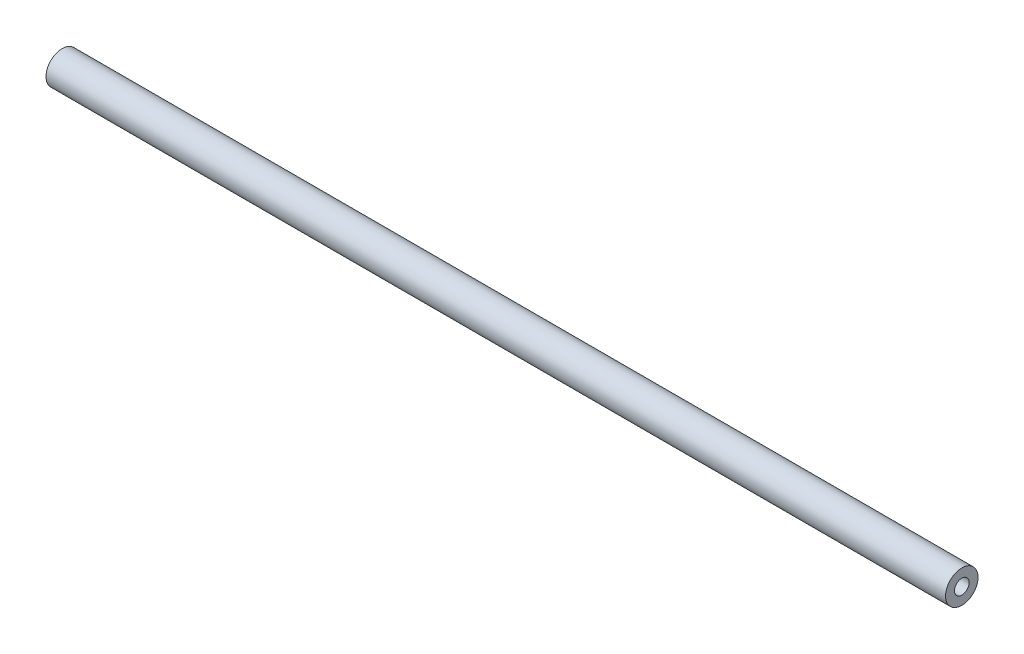
ISO-10303-21;
HEADER;
FILE_DESCRIPTION(('STEP AP214'),'2;1');
FILE_NAME('part.step','',(''),(''),'','','');
FILE_SCHEMA(('AUTOMOTIVE_DESIGN { 1 0 10303 214 1 1 1 1 }'));
ENDSEC;
DATA;
#1=APPLICATION_CONTEXT('core data for automotive mechanical design processes');
#2=APPLICATION_PROTOCOL_DEFINITION('international standard','automotive_design',2000,#1);
#3=PRODUCT_CONTEXT('',#1,'mechanical');
#4=PRODUCT('Part','Part','',(#3));
#5=PRODUCT_RELATED_PRODUCT_CATEGORY('part','',(#4));
#6=PRODUCT_DEFINITION_FORMATION('','',#4);
#7=PRODUCT_DEFINITION_CONTEXT('part definition',#1,'design');
#8=PRODUCT_DEFINITION('design','',#6,#7);
#9=PRODUCT_DEFINITION_SHAPE('','',#8);
#10=(LENGTH_UNIT() NAMED_UNIT(*) SI_UNIT(.MILLI.,.METRE.));
#11=(NAMED_UNIT(*) PLANE_ANGLE_UNIT() SI_UNIT($,.RADIAN.));
#12=(NAMED_UNIT(*) SI_UNIT($,.STERADIAN.) SOLID_ANGLE_UNIT());
#13=UNCERTAINTY_MEASURE_WITH_UNIT(LENGTH_MEASURE(1.E-05),#10,'distance_accuracy_value','');
#14=(GEOMETRIC_REPRESENTATION_CONTEXT(3) GLOBAL_UNCERTAINTY_ASSIGNED_CONTEXT((#13)) GLOBAL_UNIT_ASSIGNED_CONTEXT((#10,
#11,#12)) REPRESENTATION_CONTEXT('',''));
#15=CARTESIAN_POINT('',(0.,0.,0.));
#16=DIRECTION('',(0.,0.,1.));
#17=DIRECTION('',(1.,0.,0.));
#18=AXIS2_PLACEMENT_3D('',#15,#16,#17);
#19=CARTESIAN_POINT('',(-613.42,22.1651267806307,0.));
#20=DIRECTION('',(1.,0.,0.));
#21=DIRECTION('',(0.,0.,-1.));
#22=AXIS2_PLACEMENT_3D('',#19,#20,#21);
#23=PLANE('',#22);
#24=CARTESIAN_POINT('',(-613.42,12.6401267806307,0.));
#25=DIRECTION('',(-1.,0.,0.));
#26=DIRECTION('',(0.,0.,1.));
#27=AXIS2_PLACEMENT_3D('',#24,#25,#26);
#28=CIRCLE('',#27,4.30494980879351);
#29=CARTESIAN_POINT('',(-613.42,12.6401267806307,4.30494980879351));
#30=VERTEX_POINT('',#29);
#31=EDGE_CURVE('E11',#30,#30,#28,.T.);
#32=ORIENTED_EDGE('',*,*,#31,.F.);
#33=EDGE_LOOP('',(#32));
#34=FACE_BOUND('',#33,.T.);
#35=CARTESIAN_POINT('',(-613.42,12.6401267806307,0.));
#36=DIRECTION('',(-1.,0.,0.));
#37=DIRECTION('',(0.,0.,1.));
#38=AXIS2_PLACEMENT_3D('',#35,#36,#37);
#39=CIRCLE('',#38,9.525);
#40=CARTESIAN_POINT('',(-613.42,12.6401267806307,9.525));
#41=VERTEX_POINT('',#40);
#42=EDGE_CURVE('E62',#41,#41,#39,.T.);
#43=ORIENTED_EDGE('',*,*,#42,.T.);
#44=EDGE_LOOP('',(#43));
#45=FACE_BOUND('',#44,.T.);
#46=ADVANCED_FACE('F30',(#34,#45),#23,.F.);
#47=CARTESIAN_POINT('',(-686.612350472784,12.6401267806307,0.));
#48=DIRECTION('',(-1.,0.,0.));
#49=DIRECTION('',(0.,0.,1.));
#50=AXIS2_PLACEMENT_3D('',#47,#48,#49);
#51=CYLINDRICAL_SURFACE('',#50,4.30494980879356);
#52=CARTESIAN_POINT('',(-591.286245753739,12.6401267806307,0.));
#53=DIRECTION('',(-1.,0.,0.));
#54=DIRECTION('',(0.,0.,1.));
#55=AXIS2_PLACEMENT_3D('',#52,#53,#54);
#56=CIRCLE('',#55,4.30494980879361);
#57=CARTESIAN_POINT('',(-591.286245753739,12.6401267806307,4.30494980879361));
#58=VERTEX_POINT('',#57);
#59=EDGE_CURVE('E37',#58,#58,#56,.T.);
#60=ORIENTED_EDGE('',*,*,#59,.F.);
#61=EDGE_LOOP('',(#60));
#62=FACE_BOUND('',#61,.T.);
#63=ORIENTED_EDGE('',*,*,#31,.T.);
#64=EDGE_LOOP('',(#63));
#65=FACE_BOUND('',#64,.T.);
#66=ADVANCED_FACE('F47',(#62,#65),#51,.F.);
#67=CARTESIAN_POINT('',(-591.286245753739,12.6401267806307,0.));
#68=DIRECTION('',(-1.,0.,0.));
#69=DIRECTION('',(0.,0.,1.));
#70=AXIS2_PLACEMENT_3D('',#67,#68,#69);
#71=CONICAL_SURFACE('',#70,4.30494980879361,1.04719755119659);
#72=CARTESIAN_POINT('',(-588.800781822784,12.6401267806306,0.));
#73=VERTEX_POINT('',#72);
#74=VERTEX_LOOP('',#73);
#75=FACE_BOUND('',#74,.T.);
#76=ORIENTED_EDGE('',*,*,#59,.T.);
#77=EDGE_LOOP('',(#76));
#78=FACE_BOUND('',#77,.T.);
#79=ADVANCED_FACE('F43',(#75,#78),#71,.F.);
#80=CARTESIAN_POINT('',(-110.199218177216,12.6401267806307,0.));
#81=DIRECTION('',(1.,0.,0.));
#82=DIRECTION('',(0.,0.,-1.));
#83=AXIS2_PLACEMENT_3D('',#80,#81,#82);
#84=CONICAL_SURFACE('',#83,0.,1.04719755119664);
#85=CARTESIAN_POINT('',(-107.713754246262,12.6401267806307,0.));
#86=DIRECTION('',(-1.,0.,0.));
#87=DIRECTION('',(0.,0.,1.));
#88=AXIS2_PLACEMENT_3D('',#85,#86,#87);
#89=CIRCLE('',#88,4.30494980879356);
#90=CARTESIAN_POINT('',(-107.713754246262,12.6401267806307,4.30494980879356));
#91=VERTEX_POINT('',#90);
#92=EDGE_CURVE('E52',#91,#91,#89,.T.);
#93=ORIENTED_EDGE('',*,*,#92,.F.);
#94=EDGE_LOOP('',(#93));
#95=FACE_BOUND('',#94,.T.);
#96=CARTESIAN_POINT('',(-110.199218177216,12.6401267806307,0.));
#97=VERTEX_POINT('',#96);
#98=VERTEX_LOOP('',#97);
#99=FACE_BOUND('',#98,.T.);
#100=ADVANCED_FACE('F46',(#95,#99),#84,.F.);
#101=CARTESIAN_POINT('',(-686.612350472784,12.6401267806307,0.));
#102=DIRECTION('',(-1.,0.,0.));
#103=DIRECTION('',(0.,0.,1.));
#104=AXIS2_PLACEMENT_3D('',#101,#102,#103);
#105=CYLINDRICAL_SURFACE('',#104,4.30494980879356);
#106=CARTESIAN_POINT('',(-85.5800000000003,12.6401267806307,0.));
#107=DIRECTION('',(-1.,0.,0.));
#108=DIRECTION('',(0.,0.,1.));
#109=AXIS2_PLACEMENT_3D('',#106,#107,#108);
#110=CIRCLE('',#109,4.30494980879356);
#111=CARTESIAN_POINT('',(-85.5800000000003,12.6401267806307,4.30494980879356));
#112=VERTEX_POINT('',#111);
#113=EDGE_CURVE('E54',#112,#112,#110,.T.);
#114=ORIENTED_EDGE('',*,*,#113,.F.);
#115=EDGE_LOOP('',(#114));
#116=FACE_BOUND('',#115,.T.);
#117=ORIENTED_EDGE('',*,*,#92,.T.);
#118=EDGE_LOOP('',(#117));
#119=FACE_BOUND('',#118,.T.);
#120=ADVANCED_FACE('F76',(#116,#119),#105,.F.);
#121=CARTESIAN_POINT('',(-85.5800000000002,22.1651267806307,0.));
#122=DIRECTION('',(-1.,0.,0.));
#123=DIRECTION('',(0.,0.,1.));
#124=AXIS2_PLACEMENT_3D('',#121,#122,#123);
#125=PLANE('',#124);
#126=CARTESIAN_POINT('',(-85.58,12.6401267806307,0.));
#127=DIRECTION('',(-1.,0.,0.));
#128=DIRECTION('',(0.,0.,1.));
#129=AXIS2_PLACEMENT_3D('',#126,#127,#128);
#130=CIRCLE('',#129,9.525);
#131=CARTESIAN_POINT('',(-85.58,12.6401267806307,9.525));
#132=VERTEX_POINT('',#131);
#133=EDGE_CURVE('E59',#132,#132,#130,.T.);
#134=ORIENTED_EDGE('',*,*,#133,.F.);
#135=EDGE_LOOP('',(#134));
#136=FACE_BOUND('',#135,.T.);
#137=ORIENTED_EDGE('',*,*,#113,.T.);
#138=EDGE_LOOP('',(#137));
#139=FACE_BOUND('',#138,.T.);
#140=ADVANCED_FACE('F70',(#136,#139),#125,.F.);
#141=CARTESIAN_POINT('',(-686.612350472784,12.6401267806307,0.));
#142=DIRECTION('',(-1.,0.,0.));
#143=DIRECTION('',(0.,0.,1.));
#144=AXIS2_PLACEMENT_3D('',#141,#142,#143);
#145=CYLINDRICAL_SURFACE('',#144,9.525);
#146=ORIENTED_EDGE('',*,*,#42,.F.);
#147=EDGE_LOOP('',(#146));
#148=FACE_BOUND('',#147,.T.);
#149=ORIENTED_EDGE('',*,*,#133,.T.);
#150=EDGE_LOOP('',(#149));
#151=FACE_BOUND('',#150,.T.);
#152=ADVANCED_FACE('F67',(#148,#151),#145,.T.);
#153=CLOSED_SHELL('',(#46,#66,#79,#100,#120,#140,#152));
#154=MANIFOLD_SOLID_BREP('B2',#153);
#155=ADVANCED_BREP_SHAPE_REPRESENTATION('',(#18,#154),#14);
#156=SHAPE_DEFINITION_REPRESENTATION(#9,#155);
ENDSEC;
END-ISO-10303-21;
